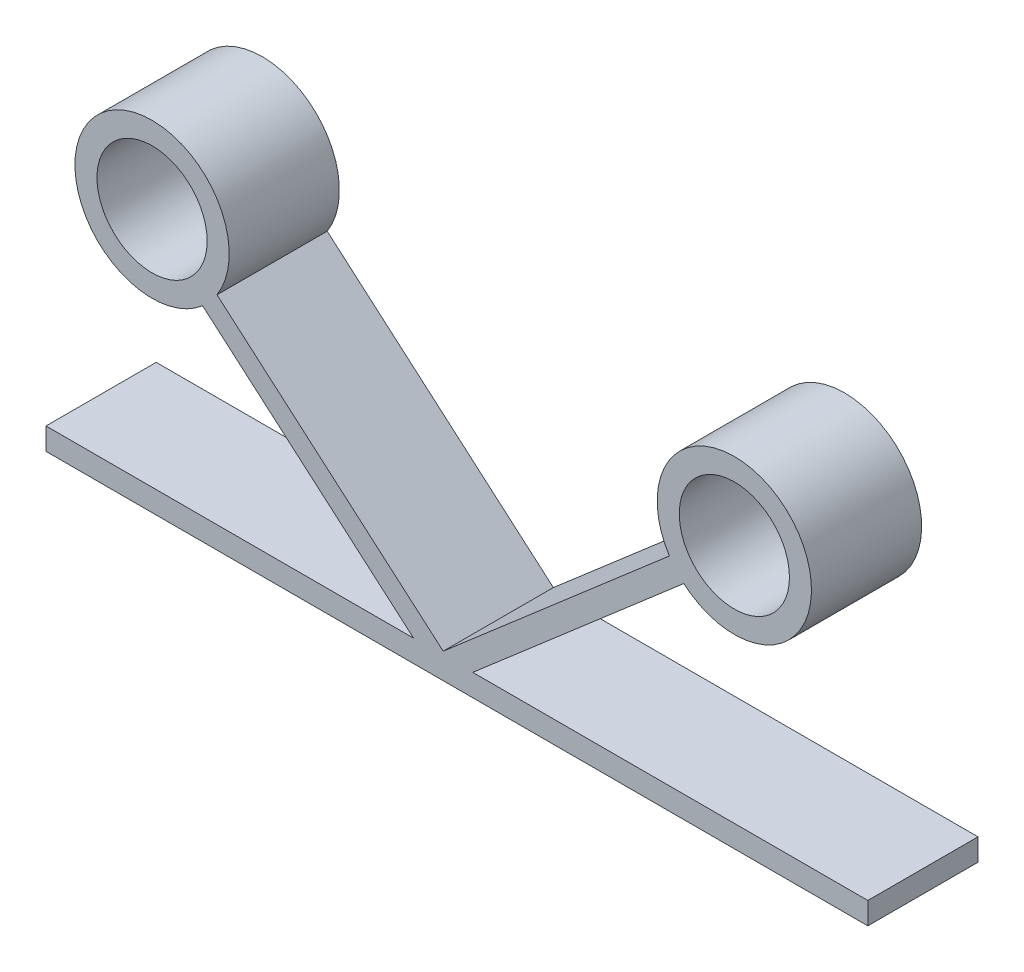
ISO-10303-21;
HEADER;
FILE_DESCRIPTION(('STEP AP214'),'2;1');
FILE_NAME('part.step','',(''),(''),'','','');
FILE_SCHEMA(('AUTOMOTIVE_DESIGN { 1 0 10303 214 1 1 1 1 }'));
ENDSEC;
DATA;
#1=APPLICATION_CONTEXT('core data for automotive mechanical design processes');
#2=APPLICATION_PROTOCOL_DEFINITION('international standard','automotive_design',2000,#1);
#3=PRODUCT_CONTEXT('',#1,'mechanical');
#4=PRODUCT('Part','Part','',(#3));
#5=PRODUCT_RELATED_PRODUCT_CATEGORY('part','',(#4));
#6=PRODUCT_DEFINITION_FORMATION('','',#4);
#7=PRODUCT_DEFINITION_CONTEXT('part definition',#1,'design');
#8=PRODUCT_DEFINITION('design','',#6,#7);
#9=PRODUCT_DEFINITION_SHAPE('','',#8);
#10=(LENGTH_UNIT() NAMED_UNIT(*) SI_UNIT(.MILLI.,.METRE.));
#11=(NAMED_UNIT(*) PLANE_ANGLE_UNIT() SI_UNIT($,.RADIAN.));
#12=(NAMED_UNIT(*) SI_UNIT($,.STERADIAN.) SOLID_ANGLE_UNIT());
#13=UNCERTAINTY_MEASURE_WITH_UNIT(LENGTH_MEASURE(1.E-05),#10,'distance_accuracy_value','');
#14=(GEOMETRIC_REPRESENTATION_CONTEXT(3) GLOBAL_UNCERTAINTY_ASSIGNED_CONTEXT((#13)) GLOBAL_UNIT_ASSIGNED_CONTEXT((#10,
#11,#12)) REPRESENTATION_CONTEXT('',''));
#15=CARTESIAN_POINT('',(0.,0.,0.));
#16=DIRECTION('',(0.,0.,1.));
#17=DIRECTION('',(1.,0.,0.));
#18=AXIS2_PLACEMENT_3D('',#15,#16,#17);
#19=CARTESIAN_POINT('',(1.63490495887638,-58.9953017907979,12.5));
#20=DIRECTION('',(-0.653961983550552,0.75652741131477,0.));
#21=DIRECTION('',(-0.75652741131477,-0.653961983550552,0.));
#22=AXIS2_PLACEMENT_3D('',#19,#20,#21);
#23=PLANE('',#22);
#24=DIRECTION('',(0.75652741131477,0.653961983550552,0.));
#25=VECTOR('',#24,1.);
#26=CARTESIAN_POINT('',(1.63490495887638,-58.9953017907979,12.5));
#27=LINE('',#26,#25);
#28=CARTESIAN_POINT('',(6.7149446584726,-54.603983262511,12.5));
#29=VERTEX_POINT('',#28);
#30=CARTESIAN_POINT('',(54.591465821719,-13.2182723455677,12.5));
#31=VERTEX_POINT('',#30);
#32=EDGE_CURVE('E97',#29,#31,#27,.T.);
#33=ORIENTED_EDGE('',*,*,#32,.F.);
#34=DIRECTION('',(0.,0.,-1.));
#35=VECTOR('',#34,1.);
#36=CARTESIAN_POINT('',(6.7149446584726,-54.603983262511,12.5));
#37=LINE('',#36,#35);
#38=CARTESIAN_POINT('',(6.7149446584726,-54.603983262511,-12.5));
#39=VERTEX_POINT('',#38);
#40=EDGE_CURVE('E190',#29,#39,#37,.T.);
#41=ORIENTED_EDGE('',*,*,#40,.T.);
#42=DIRECTION('',(0.75652741131477,0.653961983550552,0.));
#43=VECTOR('',#42,1.);
#44=CARTESIAN_POINT('',(1.63490495887638,-58.9953017907979,-12.5));
#45=LINE('',#44,#43);
#46=CARTESIAN_POINT('',(54.591465821719,-13.2182723455677,-12.5));
#47=VERTEX_POINT('',#46);
#48=EDGE_CURVE('E249',#39,#47,#45,.T.);
#49=ORIENTED_EDGE('',*,*,#48,.T.);
#50=DIRECTION('',(0.,0.,-1.));
#51=VECTOR('',#50,1.);
#52=CARTESIAN_POINT('',(54.591465821719,-13.2182723455677,12.5));
#53=LINE('',#52,#51);
#54=EDGE_CURVE('E243',#31,#47,#53,.T.);
#55=ORIENTED_EDGE('',*,*,#54,.F.);
#56=EDGE_LOOP('',(#33,#41,#49,#55));
#57=FACE_BOUND('',#56,.T.);
#58=ADVANCED_FACE('F81',(#57),#23,.F.);
#59=CARTESIAN_POINT('',(-1.63490495887638,-55.2126647342241,12.5));
#60=DIRECTION('',(-0.653961983550552,0.75652741131477,0.));
#61=DIRECTION('',(-0.75652741131477,-0.653961983550552,0.));
#62=AXIS2_PLACEMENT_3D('',#59,#60,#61);
#63=PLANE('',#62);
#64=DIRECTION('',(0.75652741131477,0.653961983550552,0.));
#65=VECTOR('',#64,1.);
#66=CARTESIAN_POINT('',(-1.63490495887638,-55.2126647342241,12.5));
#67=LINE('',#66,#65);
#68=CARTESIAN_POINT('',(0.,-53.7994103381073,12.5));
#69=VERTEX_POINT('',#68);
#70=CARTESIAN_POINT('',(51.3216559039662,-9.43563528899384,12.5));
#71=VERTEX_POINT('',#70);
#72=EDGE_CURVE('E252',#69,#71,#67,.T.);
#73=ORIENTED_EDGE('',*,*,#72,.T.);
#74=DIRECTION('',(0.,0.,-1.));
#75=VECTOR('',#74,1.);
#76=CARTESIAN_POINT('',(51.3216559039662,-9.43563528899384,12.5));
#77=LINE('',#76,#75);
#78=CARTESIAN_POINT('',(51.3216559039662,-9.43563528899382,-12.5));
#79=VERTEX_POINT('',#78);
#80=EDGE_CURVE('E90',#71,#79,#77,.T.);
#81=ORIENTED_EDGE('',*,*,#80,.T.);
#82=DIRECTION('',(0.75652741131477,0.653961983550552,0.));
#83=VECTOR('',#82,1.);
#84=CARTESIAN_POINT('',(-1.63490495887638,-55.2126647342241,-12.5));
#85=LINE('',#84,#83);
#86=CARTESIAN_POINT('',(0.,-53.7994103381073,-12.5));
#87=VERTEX_POINT('',#86);
#88=EDGE_CURVE('E266',#87,#79,#85,.T.);
#89=ORIENTED_EDGE('',*,*,#88,.F.);
#90=DIRECTION('',(0.,0.,-1.));
#91=VECTOR('',#90,1.);
#92=CARTESIAN_POINT('',(0.,-53.7994103381073,12.5));
#93=LINE('',#92,#91);
#94=EDGE_CURVE('E263',#69,#87,#93,.T.);
#95=ORIENTED_EDGE('',*,*,#94,.F.);
#96=EDGE_LOOP('',(#73,#81,#89,#95));
#97=FACE_BOUND('',#96,.T.);
#98=ADVANCED_FACE('F303',(#97),#63,.T.);
#99=CARTESIAN_POINT('',(-66.06,0.,12.5));
#100=DIRECTION('',(0.,0.,1.));
#101=DIRECTION('',(1.,0.,0.));
#102=AXIS2_PLACEMENT_3D('',#99,#100,#101);
#103=PLANE('',#102);
#104=DIRECTION('',(0.,1.,0.));
#105=VECTOR('',#104,1.);
#106=CARTESIAN_POINT('',(-90.1214522578966,-59.603983262511,12.5));
#107=LINE('',#106,#105);
#108=CARTESIAN_POINT('',(-90.1214522578966,-59.603983262511,12.5));
#109=VERTEX_POINT('',#108);
#110=CARTESIAN_POINT('',(-90.1214522578966,-54.603983262511,12.5));
#111=VERTEX_POINT('',#110);
#112=EDGE_CURVE('E175',#109,#111,#107,.T.);
#113=ORIENTED_EDGE('',*,*,#112,.F.);
#114=DIRECTION('',(1.,0.,0.));
#115=VECTOR('',#114,1.);
#116=CARTESIAN_POINT('',(-90.1214522578966,-59.603983262511,12.5));
#117=LINE('',#116,#115);
#118=CARTESIAN_POINT('',(96.346057068502,-59.603983262511,12.5));
#119=VERTEX_POINT('',#118);
#120=EDGE_CURVE('E166',#109,#119,#117,.T.);
#121=ORIENTED_EDGE('',*,*,#120,.T.);
#122=DIRECTION('',(0.,-1.,0.));
#123=VECTOR('',#122,1.);
#124=CARTESIAN_POINT('',(96.346057068502,-54.603983262511,12.5));
#125=LINE('',#124,#123);
#126=CARTESIAN_POINT('',(96.346057068502,-54.603983262511,12.5));
#127=VERTEX_POINT('',#126);
#128=EDGE_CURVE('E172',#127,#119,#125,.T.);
#129=ORIENTED_EDGE('',*,*,#128,.F.);
#130=DIRECTION('',(1.,0.,0.));
#131=VECTOR('',#130,1.);
#132=CARTESIAN_POINT('',(-90.1214522578966,-54.603983262511,12.5));
#133=LINE('',#132,#131);
#134=EDGE_CURVE('E197',#29,#127,#133,.T.);
#135=ORIENTED_EDGE('',*,*,#134,.F.);
#136=ORIENTED_EDGE('',*,*,#32,.T.);
#137=CARTESIAN_POINT('',(66.06,0.,12.5));
#138=DIRECTION('',(0.,0.,1.));
#139=DIRECTION('',(1.,0.,0.));
#140=AXIS2_PLACEMENT_3D('',#137,#138,#139);
#141=CIRCLE('',#140,17.5);
#142=EDGE_CURVE('E239',#31,#71,#141,.T.);
#143=ORIENTED_EDGE('',*,*,#142,.T.);
#144=ORIENTED_EDGE('',*,*,#72,.F.);
#145=DIRECTION('',(0.756527411314771,-0.653961983550552,0.));
#146=VECTOR('',#145,1.);
#147=CARTESIAN_POINT('',(-53.8337112827168,-7.2641492414208,12.5));
#148=LINE('',#147,#146);
#149=CARTESIAN_POINT('',(-51.3216559039662,-9.43563528899384,12.5));
#150=VERTEX_POINT('',#149);
#151=EDGE_CURVE('E256',#150,#69,#148,.T.);
#152=ORIENTED_EDGE('',*,*,#151,.F.);
#153=CARTESIAN_POINT('',(-66.06,0.,12.5));
#154=DIRECTION('',(0.,0.,1.));
#155=DIRECTION('',(1.,0.,0.));
#156=AXIS2_PLACEMENT_3D('',#153,#154,#155);
#157=CIRCLE('',#156,17.5);
#158=CARTESIAN_POINT('',(-54.591465821719,-13.2182723455677,12.5));
#159=VERTEX_POINT('',#158);
#160=EDGE_CURVE('E287',#150,#159,#157,.T.);
#161=ORIENTED_EDGE('',*,*,#160,.T.);
#162=DIRECTION('',(0.756527411314771,-0.653961983550552,0.));
#163=VECTOR('',#162,1.);
#164=CARTESIAN_POINT('',(-57.1035212004696,-11.0467862979946,12.5));
#165=LINE('',#164,#163);
#166=CARTESIAN_POINT('',(-6.71494465847258,-54.6039832625111,12.5));
#167=VERTEX_POINT('',#166);
#168=EDGE_CURVE('E259',#159,#167,#165,.T.);
#169=ORIENTED_EDGE('',*,*,#168,.T.);
#170=EDGE_CURVE('E200',#111,#167,#133,.T.);
#171=ORIENTED_EDGE('',*,*,#170,.F.);
#172=EDGE_LOOP('',(#113,#121,#129,#135,#136,#143,#144,#152,#161,#169,#171));
#173=FACE_BOUND('',#172,.T.);
#174=CARTESIAN_POINT('',(-66.06,0.,12.5));
#175=DIRECTION('',(0.,0.,1.));
#176=DIRECTION('',(1.,0.,0.));
#177=AXIS2_PLACEMENT_3D('',#174,#175,#176);
#178=CIRCLE('',#177,12.5);
#179=CARTESIAN_POINT('',(-53.56,0.,12.5));
#180=VERTEX_POINT('',#179);
#181=EDGE_CURVE('E279',#180,#180,#178,.T.);
#182=ORIENTED_EDGE('',*,*,#181,.F.);
#183=EDGE_LOOP('',(#182));
#184=FACE_BOUND('',#183,.T.);
#185=CARTESIAN_POINT('',(66.06,0.,12.5));
#186=DIRECTION('',(0.,0.,1.));
#187=DIRECTION('',(1.,0.,0.));
#188=AXIS2_PLACEMENT_3D('',#185,#186,#187);
#189=CIRCLE('',#188,12.5);
#190=CARTESIAN_POINT('',(78.56,0.,12.5));
#191=VERTEX_POINT('',#190);
#192=EDGE_CURVE('E231',#191,#191,#189,.T.);
#193=ORIENTED_EDGE('',*,*,#192,.F.);
#194=EDGE_LOOP('',(#193));
#195=FACE_BOUND('',#194,.T.);
#196=ADVANCED_FACE('F168',(#173,#184,#195),#103,.T.);
#197=CARTESIAN_POINT('',(-66.06,0.,-12.5));
#198=DIRECTION('',(0.,0.,1.));
#199=DIRECTION('',(1.,0.,0.));
#200=AXIS2_PLACEMENT_3D('',#197,#198,#199);
#201=PLANE('',#200);
#202=DIRECTION('',(1.,0.,0.));
#203=VECTOR('',#202,1.);
#204=CARTESIAN_POINT('',(-90.1214522578966,-59.603983262511,-12.5));
#205=LINE('',#204,#203);
#206=CARTESIAN_POINT('',(-90.1214522578966,-59.603983262511,-12.5));
#207=VERTEX_POINT('',#206);
#208=CARTESIAN_POINT('',(96.346057068502,-59.603983262511,-12.5));
#209=VERTEX_POINT('',#208);
#210=EDGE_CURVE('E185',#207,#209,#205,.T.);
#211=ORIENTED_EDGE('',*,*,#210,.F.);
#212=DIRECTION('',(0.,1.,0.));
#213=VECTOR('',#212,1.);
#214=CARTESIAN_POINT('',(-90.1214522578966,-59.603983262511,-12.5));
#215=LINE('',#214,#213);
#216=CARTESIAN_POINT('',(-90.1214522578966,-54.603983262511,-12.5));
#217=VERTEX_POINT('',#216);
#218=EDGE_CURVE('E180',#207,#217,#215,.T.);
#219=ORIENTED_EDGE('',*,*,#218,.T.);
#220=DIRECTION('',(1.,0.,0.));
#221=VECTOR('',#220,1.);
#222=CARTESIAN_POINT('',(-90.1214522578966,-54.603983262511,-12.5));
#223=LINE('',#222,#221);
#224=CARTESIAN_POINT('',(-6.71494465847258,-54.6039832625111,-12.5));
#225=VERTEX_POINT('',#224);
#226=EDGE_CURVE('E214',#217,#225,#223,.T.);
#227=ORIENTED_EDGE('',*,*,#226,.T.);
#228=DIRECTION('',(0.756527411314771,-0.653961983550552,0.));
#229=VECTOR('',#228,1.);
#230=CARTESIAN_POINT('',(-57.1035212004696,-11.0467862979946,-12.5));
#231=LINE('',#230,#229);
#232=CARTESIAN_POINT('',(-54.591465821719,-13.2182723455677,-12.5));
#233=VERTEX_POINT('',#232);
#234=EDGE_CURVE('E104',#233,#225,#231,.T.);
#235=ORIENTED_EDGE('',*,*,#234,.F.);
#236=CARTESIAN_POINT('',(-66.06,0.,-12.5));
#237=DIRECTION('',(0.,0.,1.));
#238=DIRECTION('',(1.,0.,0.));
#239=AXIS2_PLACEMENT_3D('',#236,#237,#238);
#240=CIRCLE('',#239,17.5);
#241=CARTESIAN_POINT('',(-51.3216559039662,-9.43563528899385,-12.5));
#242=VERTEX_POINT('',#241);
#243=EDGE_CURVE('E283',#242,#233,#240,.T.);
#244=ORIENTED_EDGE('',*,*,#243,.F.);
#245=DIRECTION('',(0.756527411314771,-0.653961983550552,0.));
#246=VECTOR('',#245,1.);
#247=CARTESIAN_POINT('',(-53.8337112827168,-7.2641492414208,-12.5));
#248=LINE('',#247,#246);
#249=EDGE_CURVE('E270',#242,#87,#248,.T.);
#250=ORIENTED_EDGE('',*,*,#249,.T.);
#251=ORIENTED_EDGE('',*,*,#88,.T.);
#252=CARTESIAN_POINT('',(66.06,0.,-12.5));
#253=DIRECTION('',(0.,0.,1.));
#254=DIRECTION('',(1.,0.,0.));
#255=AXIS2_PLACEMENT_3D('',#252,#253,#254);
#256=CIRCLE('',#255,17.5);
#257=EDGE_CURVE('E235',#47,#79,#256,.T.);
#258=ORIENTED_EDGE('',*,*,#257,.F.);
#259=ORIENTED_EDGE('',*,*,#48,.F.);
#260=CARTESIAN_POINT('',(96.346057068502,-54.603983262511,-12.5));
#261=VERTEX_POINT('',#260);
#262=EDGE_CURVE('E213',#39,#261,#223,.T.);
#263=ORIENTED_EDGE('',*,*,#262,.T.);
#264=DIRECTION('',(0.,-1.,0.));
#265=VECTOR('',#264,1.);
#266=CARTESIAN_POINT('',(96.346057068502,-54.603983262511,-12.5));
#267=LINE('',#266,#265);
#268=EDGE_CURVE('E210',#261,#209,#267,.T.);
#269=ORIENTED_EDGE('',*,*,#268,.T.);
#270=EDGE_LOOP('',(#211,#219,#227,#235,#244,#250,#251,#258,#259,#263,#269));
#271=FACE_BOUND('',#270,.T.);
#272=CARTESIAN_POINT('',(-66.06,0.,-12.5));
#273=DIRECTION('',(0.,0.,1.));
#274=DIRECTION('',(1.,0.,0.));
#275=AXIS2_PLACEMENT_3D('',#272,#273,#274);
#276=CIRCLE('',#275,12.5);
#277=CARTESIAN_POINT('',(-53.56,0.,-12.5));
#278=VERTEX_POINT('',#277);
#279=EDGE_CURVE('E278',#278,#278,#276,.T.);
#280=ORIENTED_EDGE('',*,*,#279,.T.);
#281=EDGE_LOOP('',(#280));
#282=FACE_BOUND('',#281,.T.);
#283=CARTESIAN_POINT('',(66.06,0.,-12.5));
#284=DIRECTION('',(0.,0.,1.));
#285=DIRECTION('',(1.,0.,0.));
#286=AXIS2_PLACEMENT_3D('',#283,#284,#285);
#287=CIRCLE('',#286,12.5);
#288=CARTESIAN_POINT('',(78.56,0.,-12.5));
#289=VERTEX_POINT('',#288);
#290=EDGE_CURVE('E230',#289,#289,#287,.T.);
#291=ORIENTED_EDGE('',*,*,#290,.T.);
#292=EDGE_LOOP('',(#291));
#293=FACE_BOUND('',#292,.T.);
#294=ADVANCED_FACE('F310',(#271,#282,#293),#201,.F.);
#295=CARTESIAN_POINT('',(-66.06,0.,12.5));
#296=DIRECTION('',(0.,0.,-1.));
#297=DIRECTION('',(-1.,0.,0.));
#298=AXIS2_PLACEMENT_3D('',#295,#296,#297);
#299=CYLINDRICAL_SURFACE('',#298,17.5);
#300=ORIENTED_EDGE('',*,*,#160,.F.);
#301=DIRECTION('',(0.,0.,-1.));
#302=VECTOR('',#301,1.);
#303=CARTESIAN_POINT('',(-51.3216559039662,-9.43563528899385,12.5));
#304=LINE('',#303,#302);
#305=EDGE_CURVE('E296',#150,#242,#304,.T.);
#306=ORIENTED_EDGE('',*,*,#305,.T.);
#307=ORIENTED_EDGE('',*,*,#243,.T.);
#308=DIRECTION('',(0.,0.,-1.));
#309=VECTOR('',#308,1.);
#310=CARTESIAN_POINT('',(-54.591465821719,-13.2182723455677,12.5));
#311=LINE('',#310,#309);
#312=EDGE_CURVE('E291',#159,#233,#311,.T.);
#313=ORIENTED_EDGE('',*,*,#312,.F.);
#314=EDGE_LOOP('',(#300,#306,#307,#313));
#315=FACE_BOUND('',#314,.T.);
#316=ADVANCED_FACE('F83',(#315),#299,.T.);
#317=CARTESIAN_POINT('',(-66.06,0.,12.5));
#318=DIRECTION('',(0.,0.,-1.));
#319=DIRECTION('',(-1.,0.,0.));
#320=AXIS2_PLACEMENT_3D('',#317,#318,#319);
#321=CYLINDRICAL_SURFACE('',#320,12.5);
#322=ORIENTED_EDGE('',*,*,#181,.T.);
#323=EDGE_LOOP('',(#322));
#324=FACE_BOUND('',#323,.T.);
#325=ORIENTED_EDGE('',*,*,#279,.F.);
#326=EDGE_LOOP('',(#325));
#327=FACE_BOUND('',#326,.T.);
#328=ADVANCED_FACE('F343',(#324,#327),#321,.F.);
#329=CARTESIAN_POINT('',(-53.8337112827168,-7.2641492414208,12.5));
#330=DIRECTION('',(0.653961983550552,0.756527411314771,0.));
#331=DIRECTION('',(-0.756527411314771,0.653961983550552,0.));
#332=AXIS2_PLACEMENT_3D('',#329,#330,#331);
#333=PLANE('',#332);
#334=ORIENTED_EDGE('',*,*,#305,.F.);
#335=ORIENTED_EDGE('',*,*,#151,.T.);
#336=ORIENTED_EDGE('',*,*,#94,.T.);
#337=ORIENTED_EDGE('',*,*,#249,.F.);
#338=EDGE_LOOP('',(#334,#335,#336,#337));
#339=FACE_BOUND('',#338,.T.);
#340=ADVANCED_FACE('F315',(#339),#333,.T.);
#341=CARTESIAN_POINT('',(-57.1035212004696,-11.0467862979946,12.5));
#342=DIRECTION('',(0.653961983550552,0.756527411314771,0.));
#343=DIRECTION('',(-0.756527411314771,0.653961983550552,0.));
#344=AXIS2_PLACEMENT_3D('',#341,#342,#343);
#345=PLANE('',#344);
#346=ORIENTED_EDGE('',*,*,#234,.T.);
#347=DIRECTION('',(0.,0.,1.));
#348=VECTOR('',#347,1.);
#349=CARTESIAN_POINT('',(-6.7149446584726,-54.603983262511,12.5));
#350=LINE('',#349,#348);
#351=EDGE_CURVE('E12',#225,#167,#350,.T.);
#352=ORIENTED_EDGE('',*,*,#351,.T.);
#353=ORIENTED_EDGE('',*,*,#168,.F.);
#354=ORIENTED_EDGE('',*,*,#312,.T.);
#355=EDGE_LOOP('',(#346,#352,#353,#354));
#356=FACE_BOUND('',#355,.T.);
#357=ADVANCED_FACE('F356',(#356),#345,.F.);
#358=CARTESIAN_POINT('',(66.06,0.,12.5));
#359=DIRECTION('',(0.,0.,-1.));
#360=DIRECTION('',(-1.,0.,0.));
#361=AXIS2_PLACEMENT_3D('',#358,#359,#360);
#362=CYLINDRICAL_SURFACE('',#361,17.5);
#363=ORIENTED_EDGE('',*,*,#142,.F.);
#364=ORIENTED_EDGE('',*,*,#54,.T.);
#365=ORIENTED_EDGE('',*,*,#257,.T.);
#366=ORIENTED_EDGE('',*,*,#80,.F.);
#367=EDGE_LOOP('',(#363,#364,#365,#366));
#368=FACE_BOUND('',#367,.T.);
#369=ADVANCED_FACE('F317',(#368),#362,.T.);
#370=CARTESIAN_POINT('',(66.06,0.,12.5));
#371=DIRECTION('',(0.,0.,-1.));
#372=DIRECTION('',(-1.,0.,0.));
#373=AXIS2_PLACEMENT_3D('',#370,#371,#372);
#374=CYLINDRICAL_SURFACE('',#373,12.5);
#375=ORIENTED_EDGE('',*,*,#192,.T.);
#376=EDGE_LOOP('',(#375));
#377=FACE_BOUND('',#376,.T.);
#378=ORIENTED_EDGE('',*,*,#290,.F.);
#379=EDGE_LOOP('',(#378));
#380=FACE_BOUND('',#379,.T.);
#381=ADVANCED_FACE('F361',(#377,#380),#374,.F.);
#382=CARTESIAN_POINT('',(-90.1214522578966,-59.603983262511,12.5));
#383=DIRECTION('',(-1.,0.,0.));
#384=DIRECTION('',(0.,0.,1.));
#385=AXIS2_PLACEMENT_3D('',#382,#383,#384);
#386=PLANE('',#385);
#387=ORIENTED_EDGE('',*,*,#218,.F.);
#388=DIRECTION('',(0.,0.,-1.));
#389=VECTOR('',#388,1.);
#390=CARTESIAN_POINT('',(-90.1214522578966,-59.603983262511,12.5));
#391=LINE('',#390,#389);
#392=EDGE_CURVE('E207',#109,#207,#391,.T.);
#393=ORIENTED_EDGE('',*,*,#392,.F.);
#394=ORIENTED_EDGE('',*,*,#112,.T.);
#395=DIRECTION('',(0.,0.,-1.));
#396=VECTOR('',#395,1.);
#397=CARTESIAN_POINT('',(-90.1214522578966,-54.603983262511,12.5));
#398=LINE('',#397,#396);
#399=EDGE_CURVE('E223',#111,#217,#398,.T.);
#400=ORIENTED_EDGE('',*,*,#399,.T.);
#401=EDGE_LOOP('',(#387,#393,#394,#400));
#402=FACE_BOUND('',#401,.T.);
#403=ADVANCED_FACE('F333',(#402),#386,.T.);
#404=CARTESIAN_POINT('',(-90.1214522578966,-54.603983262511,12.5));
#405=DIRECTION('',(0.,1.,0.));
#406=DIRECTION('',(0.,0.,1.));
#407=AXIS2_PLACEMENT_3D('',#404,#405,#406);
#408=PLANE('',#407);
#409=ORIENTED_EDGE('',*,*,#351,.F.);
#410=ORIENTED_EDGE('',*,*,#226,.F.);
#411=ORIENTED_EDGE('',*,*,#399,.F.);
#412=ORIENTED_EDGE('',*,*,#170,.T.);
#413=EDGE_LOOP('',(#409,#410,#411,#412));
#414=FACE_BOUND('',#413,.T.);
#415=ADVANCED_FACE('F324',(#414),#408,.T.);
#416=CARTESIAN_POINT('',(-90.1214522578966,-59.603983262511,12.5));
#417=DIRECTION('',(0.,1.,0.));
#418=DIRECTION('',(0.,0.,1.));
#419=AXIS2_PLACEMENT_3D('',#416,#417,#418);
#420=PLANE('',#419);
#421=DIRECTION('',(0.,0.,-1.));
#422=VECTOR('',#421,1.);
#423=CARTESIAN_POINT('',(96.346057068502,-59.603983262511,12.5));
#424=LINE('',#423,#422);
#425=EDGE_CURVE('E183',#119,#209,#424,.T.);
#426=ORIENTED_EDGE('',*,*,#425,.F.);
#427=ORIENTED_EDGE('',*,*,#120,.F.);
#428=ORIENTED_EDGE('',*,*,#392,.T.);
#429=ORIENTED_EDGE('',*,*,#210,.T.);
#430=EDGE_LOOP('',(#426,#427,#428,#429));
#431=FACE_BOUND('',#430,.T.);
#432=ADVANCED_FACE('F184',(#431),#420,.F.);
#433=ORIENTED_EDGE('',*,*,#40,.F.);
#434=ORIENTED_EDGE('',*,*,#134,.T.);
#435=DIRECTION('',(0.,0.,-1.));
#436=VECTOR('',#435,1.);
#437=CARTESIAN_POINT('',(96.346057068502,-54.603983262511,12.5));
#438=LINE('',#437,#436);
#439=EDGE_CURVE('E191',#127,#261,#438,.T.);
#440=ORIENTED_EDGE('',*,*,#439,.T.);
#441=ORIENTED_EDGE('',*,*,#262,.F.);
#442=EDGE_LOOP('',(#433,#434,#440,#441));
#443=FACE_BOUND('',#442,.T.);
#444=ADVANCED_FACE('F321',(#443),#408,.T.);
#445=CARTESIAN_POINT('',(96.346057068502,-54.603983262511,12.5));
#446=DIRECTION('',(1.,0.,0.));
#447=DIRECTION('',(0.,0.,-1.));
#448=AXIS2_PLACEMENT_3D('',#445,#446,#447);
#449=PLANE('',#448);
#450=ORIENTED_EDGE('',*,*,#268,.F.);
#451=ORIENTED_EDGE('',*,*,#439,.F.);
#452=ORIENTED_EDGE('',*,*,#128,.T.);
#453=ORIENTED_EDGE('',*,*,#425,.T.);
#454=EDGE_LOOP('',(#450,#451,#452,#453));
#455=FACE_BOUND('',#454,.T.);
#456=ADVANCED_FACE('F194',(#455),#449,.T.);
#457=CLOSED_SHELL('',(#58,#98,#196,#294,#316,#328,#340,#357,#369,#381,#403,#415,#432,#444,#456));
#458=MANIFOLD_SOLID_BREP('B2',#457);
#459=ADVANCED_BREP_SHAPE_REPRESENTATION('',(#18,#458),#14);
#460=SHAPE_DEFINITION_REPRESENTATION(#9,#459);
ENDSEC;
END-ISO-10303-21;
